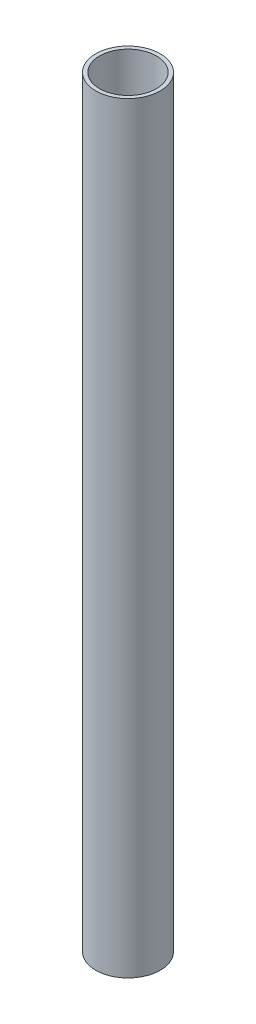
ISO-10303-21;
HEADER;
FILE_DESCRIPTION(('STEP AP214'),'2;1');
FILE_NAME('part.step','',(''),(''),'','','');
FILE_SCHEMA(('AUTOMOTIVE_DESIGN { 1 0 10303 214 1 1 1 1 }'));
ENDSEC;
DATA;
#1=APPLICATION_CONTEXT('core data for automotive mechanical design processes');
#2=APPLICATION_PROTOCOL_DEFINITION('international standard','automotive_design',2000,#1);
#3=PRODUCT_CONTEXT('',#1,'mechanical');
#4=PRODUCT('Part','Part','',(#3));
#5=PRODUCT_RELATED_PRODUCT_CATEGORY('part','',(#4));
#6=PRODUCT_DEFINITION_FORMATION('','',#4);
#7=PRODUCT_DEFINITION_CONTEXT('part definition',#1,'design');
#8=PRODUCT_DEFINITION('design','',#6,#7);
#9=PRODUCT_DEFINITION_SHAPE('','',#8);
#10=(LENGTH_UNIT() NAMED_UNIT(*) SI_UNIT(.MILLI.,.METRE.));
#11=(NAMED_UNIT(*) PLANE_ANGLE_UNIT() SI_UNIT($,.RADIAN.));
#12=(NAMED_UNIT(*) SI_UNIT($,.STERADIAN.) SOLID_ANGLE_UNIT());
#13=UNCERTAINTY_MEASURE_WITH_UNIT(LENGTH_MEASURE(1.E-05),#10,'distance_accuracy_value','');
#14=(GEOMETRIC_REPRESENTATION_CONTEXT(3) GLOBAL_UNCERTAINTY_ASSIGNED_CONTEXT((#13)) GLOBAL_UNIT_ASSIGNED_CONTEXT((#10,
#11,#12)) REPRESENTATION_CONTEXT('',''));
#15=CARTESIAN_POINT('',(0.,0.,0.));
#16=DIRECTION('',(0.,0.,1.));
#17=DIRECTION('',(1.,0.,0.));
#18=AXIS2_PLACEMENT_3D('',#15,#16,#17);
#19=CARTESIAN_POINT('',(0.,1000.,0.));
#20=DIRECTION('',(0.,-1.,0.));
#21=DIRECTION('',(0.,0.,-1.));
#22=AXIS2_PLACEMENT_3D('',#19,#20,#21);
#23=CYLINDRICAL_SURFACE('',#22,42.3);
#24=CARTESIAN_POINT('',(0.,1000.,0.));
#25=DIRECTION('',(0.,1.,0.));
#26=DIRECTION('',(0.,0.,1.));
#27=AXIS2_PLACEMENT_3D('',#24,#25,#26);
#28=CIRCLE('',#27,42.3);
#29=CARTESIAN_POINT('',(0.,1000.,42.3));
#30=VERTEX_POINT('',#29);
#31=EDGE_CURVE('E10',#30,#30,#28,.T.);
#32=ORIENTED_EDGE('',*,*,#31,.F.);
#33=EDGE_LOOP('',(#32));
#34=FACE_BOUND('',#33,.T.);
#35=CARTESIAN_POINT('',(0.,0.,0.));
#36=DIRECTION('',(0.,1.,0.));
#37=DIRECTION('',(0.,0.,1.));
#38=AXIS2_PLACEMENT_3D('',#35,#36,#37);
#39=CIRCLE('',#38,42.3);
#40=CARTESIAN_POINT('',(0.,0.,42.3));
#41=VERTEX_POINT('',#40);
#42=EDGE_CURVE('E34',#41,#41,#39,.T.);
#43=ORIENTED_EDGE('',*,*,#42,.T.);
#44=EDGE_LOOP('',(#43));
#45=FACE_BOUND('',#44,.T.);
#46=ADVANCED_FACE('F31',(#34,#45),#23,.T.);
#47=CARTESIAN_POINT('',(0.,1000.,0.));
#48=DIRECTION('',(0.,1.,0.));
#49=DIRECTION('',(0.,0.,1.));
#50=AXIS2_PLACEMENT_3D('',#47,#48,#49);
#51=PLANE('',#50);
#52=CARTESIAN_POINT('',(0.,1000.,0.));
#53=DIRECTION('',(0.,1.,0.));
#54=DIRECTION('',(0.,0.,1.));
#55=AXIS2_PLACEMENT_3D('',#52,#53,#54);
#56=CIRCLE('',#55,37.3);
#57=CARTESIAN_POINT('',(0.,1000.,37.3));
#58=VERTEX_POINT('',#57);
#59=EDGE_CURVE('E41',#58,#58,#56,.T.);
#60=ORIENTED_EDGE('',*,*,#59,.F.);
#61=EDGE_LOOP('',(#60));
#62=FACE_BOUND('',#61,.T.);
#63=ORIENTED_EDGE('',*,*,#31,.T.);
#64=EDGE_LOOP('',(#63));
#65=FACE_BOUND('',#64,.T.);
#66=ADVANCED_FACE('F61',(#62,#65),#51,.T.);
#67=CARTESIAN_POINT('',(0.,0.,0.));
#68=DIRECTION('',(0.,1.,0.));
#69=DIRECTION('',(0.,0.,1.));
#70=AXIS2_PLACEMENT_3D('',#67,#68,#69);
#71=PLANE('',#70);
#72=ORIENTED_EDGE('',*,*,#42,.F.);
#73=EDGE_LOOP('',(#72));
#74=FACE_BOUND('',#73,.T.);
#75=ADVANCED_FACE('F53',(#74),#71,.F.);
#76=CARTESIAN_POINT('',(0.,1000.,0.));
#77=DIRECTION('',(0.,-1.,0.));
#78=DIRECTION('',(0.,0.,-1.));
#79=AXIS2_PLACEMENT_3D('',#76,#77,#78);
#80=CYLINDRICAL_SURFACE('',#79,37.3);
#81=ORIENTED_EDGE('',*,*,#59,.T.);
#82=EDGE_LOOP('',(#81));
#83=FACE_BOUND('',#82,.T.);
#84=CARTESIAN_POINT('',(0.,5.,0.));
#85=DIRECTION('',(0.,1.,0.));
#86=DIRECTION('',(0.,0.,1.));
#87=AXIS2_PLACEMENT_3D('',#84,#85,#86);
#88=CIRCLE('',#87,37.3);
#89=CARTESIAN_POINT('',(0.,5.,37.3));
#90=VERTEX_POINT('',#89);
#91=EDGE_CURVE('E45',#90,#90,#88,.T.);
#92=ORIENTED_EDGE('',*,*,#91,.F.);
#93=EDGE_LOOP('',(#92));
#94=FACE_BOUND('',#93,.T.);
#95=ADVANCED_FACE('F51',(#83,#94),#80,.F.);
#96=CARTESIAN_POINT('',(0.,5.,0.));
#97=DIRECTION('',(0.,1.,0.));
#98=DIRECTION('',(0.,0.,1.));
#99=AXIS2_PLACEMENT_3D('',#96,#97,#98);
#100=PLANE('',#99);
#101=ORIENTED_EDGE('',*,*,#91,.T.);
#102=EDGE_LOOP('',(#101));
#103=FACE_BOUND('',#102,.T.);
#104=ADVANCED_FACE('F49',(#103),#100,.T.);
#105=CLOSED_SHELL('',(#46,#66,#75,#95,#104));
#106=MANIFOLD_SOLID_BREP('B2',#105);
#107=ADVANCED_BREP_SHAPE_REPRESENTATION('',(#18,#106),#14);
#108=SHAPE_DEFINITION_REPRESENTATION(#9,#107);
ENDSEC;
END-ISO-10303-21;
